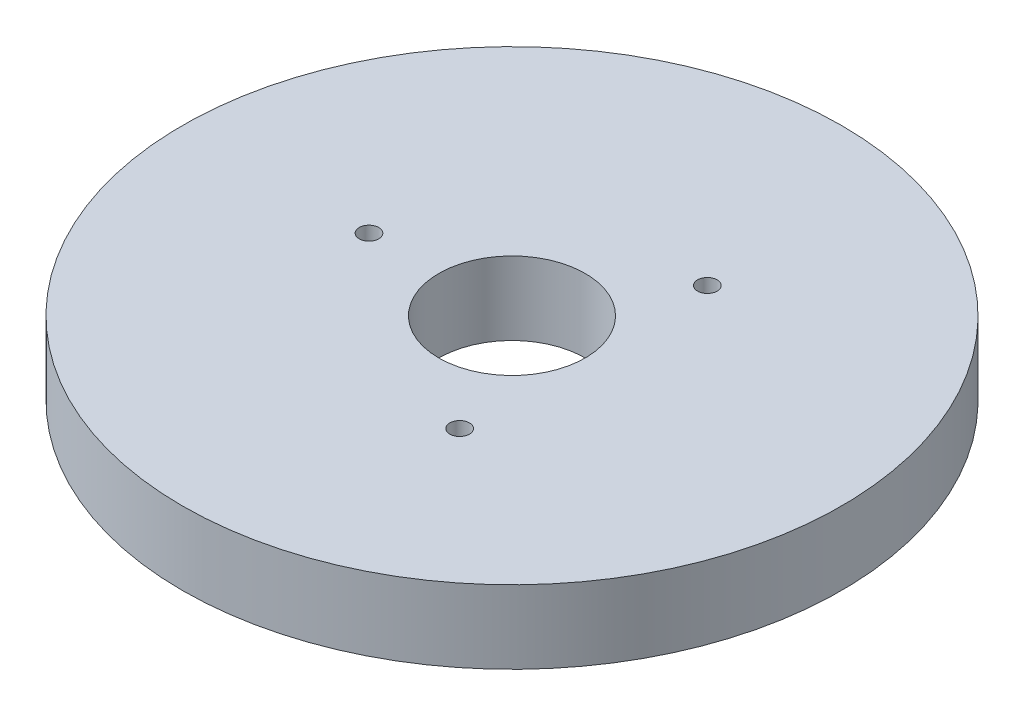
ISO-10303-21;
HEADER;
FILE_DESCRIPTION(('STEP AP214'),'2;1');
FILE_NAME('part.step','',(''),(''),'','','');
FILE_SCHEMA(('AUTOMOTIVE_DESIGN { 1 0 10303 214 1 1 1 1 }'));
ENDSEC;
DATA;
#1=APPLICATION_CONTEXT('core data for automotive mechanical design processes');
#2=APPLICATION_PROTOCOL_DEFINITION('international standard','automotive_design',2000,#1);
#3=PRODUCT_CONTEXT('',#1,'mechanical');
#4=PRODUCT('Part','Part','',(#3));
#5=PRODUCT_RELATED_PRODUCT_CATEGORY('part','',(#4));
#6=PRODUCT_DEFINITION_FORMATION('','',#4);
#7=PRODUCT_DEFINITION_CONTEXT('part definition',#1,'design');
#8=PRODUCT_DEFINITION('design','',#6,#7);
#9=PRODUCT_DEFINITION_SHAPE('','',#8);
#10=(LENGTH_UNIT() NAMED_UNIT(*) SI_UNIT(.MILLI.,.METRE.));
#11=(NAMED_UNIT(*) PLANE_ANGLE_UNIT() SI_UNIT($,.RADIAN.));
#12=(NAMED_UNIT(*) SI_UNIT($,.STERADIAN.) SOLID_ANGLE_UNIT());
#13=UNCERTAINTY_MEASURE_WITH_UNIT(LENGTH_MEASURE(1.E-05),#10,'distance_accuracy_value','');
#14=(GEOMETRIC_REPRESENTATION_CONTEXT(3) GLOBAL_UNCERTAINTY_ASSIGNED_CONTEXT((#13)) GLOBAL_UNIT_ASSIGNED_CONTEXT((#10,
#11,#12)) REPRESENTATION_CONTEXT('',''));
#15=CARTESIAN_POINT('',(0.,0.,0.));
#16=DIRECTION('',(0.,0.,1.));
#17=DIRECTION('',(1.,0.,0.));
#18=AXIS2_PLACEMENT_3D('',#15,#16,#17);
#19=CARTESIAN_POINT('',(0.,20.,0.));
#20=DIRECTION('',(0.,-1.,0.));
#21=DIRECTION('',(0.,0.,-1.));
#22=AXIS2_PLACEMENT_3D('',#19,#20,#21);
#23=CYLINDRICAL_SURFACE('',#22,90.);
#24=CARTESIAN_POINT('',(0.,20.,0.));
#25=DIRECTION('',(0.,1.,0.));
#26=DIRECTION('',(0.,0.,1.));
#27=AXIS2_PLACEMENT_3D('',#24,#25,#26);
#28=CIRCLE('',#27,90.);
#29=CARTESIAN_POINT('',(0.,20.,90.));
#30=VERTEX_POINT('',#29);
#31=EDGE_CURVE('E10',#30,#30,#28,.T.);
#32=ORIENTED_EDGE('',*,*,#31,.F.);
#33=EDGE_LOOP('',(#32));
#34=FACE_BOUND('',#33,.T.);
#35=CARTESIAN_POINT('',(0.,0.,0.));
#36=DIRECTION('',(0.,1.,0.));
#37=DIRECTION('',(0.,0.,1.));
#38=AXIS2_PLACEMENT_3D('',#35,#36,#37);
#39=CIRCLE('',#38,90.);
#40=CARTESIAN_POINT('',(0.,0.,90.));
#41=VERTEX_POINT('',#40);
#42=EDGE_CURVE('E37',#41,#41,#39,.T.);
#43=ORIENTED_EDGE('',*,*,#42,.T.);
#44=EDGE_LOOP('',(#43));
#45=FACE_BOUND('',#44,.T.);
#46=ADVANCED_FACE('F40',(#34,#45),#23,.T.);
#47=CARTESIAN_POINT('',(0.,20.,0.));
#48=DIRECTION('',(0.,1.,0.));
#49=DIRECTION('',(0.,0.,1.));
#50=AXIS2_PLACEMENT_3D('',#47,#48,#49);
#51=PLANE('',#50);
#52=CARTESIAN_POINT('',(19.5290018990693,20.,33.8252235102968));
#53=DIRECTION('',(0.,1.,0.));
#54=DIRECTION('',(0.866025403784436,0.,-0.500000000000004));
#55=AXIS2_PLACEMENT_3D('',#52,#53,#54);
#56=CIRCLE('',#55,2.67580100674816);
#57=CARTESIAN_POINT('',(21.8463135463852,20.,32.4873230069227));
#58=VERTEX_POINT('',#57);
#59=EDGE_CURVE('E70',#58,#58,#56,.T.);
#60=ORIENTED_EDGE('',*,*,#59,.F.);
#61=EDGE_LOOP('',(#60));
#62=FACE_BOUND('',#61,.T.);
#63=CARTESIAN_POINT('',(19.5290018990688,20.,-33.825223510297));
#64=DIRECTION('',(0.,1.,0.));
#65=DIRECTION('',(-0.866025403784443,0.,-0.499999999999992));
#66=AXIS2_PLACEMENT_3D('',#63,#64,#65);
#67=CIRCLE('',#66,2.67580100674816);
#68=CARTESIAN_POINT('',(17.2116902517529,20.,-35.1631240136711));
#69=VERTEX_POINT('',#68);
#70=EDGE_CURVE('E61',#69,#69,#67,.T.);
#71=ORIENTED_EDGE('',*,*,#70,.F.);
#72=EDGE_LOOP('',(#71));
#73=FACE_BOUND('',#72,.T.);
#74=CARTESIAN_POINT('',(-39.0580037981383,20.,0.));
#75=DIRECTION('',(0.,1.,0.));
#76=DIRECTION('',(0.,0.,1.));
#77=AXIS2_PLACEMENT_3D('',#74,#75,#76);
#78=CIRCLE('',#77,2.67580100674816);
#79=CARTESIAN_POINT('',(-39.0580037981383,20.,2.67580100674816));
#80=VERTEX_POINT('',#79);
#81=EDGE_CURVE('E54',#80,#80,#78,.T.);
#82=ORIENTED_EDGE('',*,*,#81,.F.);
#83=EDGE_LOOP('',(#82));
#84=FACE_BOUND('',#83,.T.);
#85=CARTESIAN_POINT('',(0.,20.,0.));
#86=DIRECTION('',(0.,1.,0.));
#87=DIRECTION('',(0.,0.,1.));
#88=AXIS2_PLACEMENT_3D('',#85,#86,#87);
#89=CIRCLE('',#88,20.);
#90=CARTESIAN_POINT('',(0.,20.,20.));
#91=VERTEX_POINT('',#90);
#92=EDGE_CURVE('E50',#91,#91,#89,.T.);
#93=ORIENTED_EDGE('',*,*,#92,.F.);
#94=EDGE_LOOP('',(#93));
#95=FACE_BOUND('',#94,.T.);
#96=ORIENTED_EDGE('',*,*,#31,.T.);
#97=EDGE_LOOP('',(#96));
#98=FACE_BOUND('',#97,.T.);
#99=ADVANCED_FACE('F85',(#62,#73,#84,#95,#98),#51,.T.);
#100=CARTESIAN_POINT('',(0.,0.,0.));
#101=DIRECTION('',(0.,1.,0.));
#102=DIRECTION('',(0.,0.,1.));
#103=AXIS2_PLACEMENT_3D('',#100,#101,#102);
#104=PLANE('',#103);
#105=CARTESIAN_POINT('',(0.,0.,0.));
#106=DIRECTION('',(0.,1.,0.));
#107=DIRECTION('',(0.,0.,1.));
#108=AXIS2_PLACEMENT_3D('',#105,#106,#107);
#109=CIRCLE('',#108,20.);
#110=CARTESIAN_POINT('',(0.,0.,20.));
#111=VERTEX_POINT('',#110);
#112=EDGE_CURVE('E47',#111,#111,#109,.T.);
#113=ORIENTED_EDGE('',*,*,#112,.T.);
#114=EDGE_LOOP('',(#113));
#115=FACE_BOUND('',#114,.T.);
#116=ORIENTED_EDGE('',*,*,#42,.F.);
#117=EDGE_LOOP('',(#116));
#118=FACE_BOUND('',#117,.T.);
#119=ADVANCED_FACE('F84',(#115,#118),#104,.F.);
#120=CARTESIAN_POINT('',(0.,20.,0.));
#121=DIRECTION('',(0.,-1.,0.));
#122=DIRECTION('',(0.,0.,-1.));
#123=AXIS2_PLACEMENT_3D('',#120,#121,#122);
#124=CYLINDRICAL_SURFACE('',#123,20.);
#125=ORIENTED_EDGE('',*,*,#92,.T.);
#126=EDGE_LOOP('',(#125));
#127=FACE_BOUND('',#126,.T.);
#128=ORIENTED_EDGE('',*,*,#112,.F.);
#129=EDGE_LOOP('',(#128));
#130=FACE_BOUND('',#129,.T.);
#131=ADVANCED_FACE('F91',(#127,#130),#124,.F.);
#132=CARTESIAN_POINT('',(-39.0580037981383,7.75066715070129,0.));
#133=DIRECTION('',(0.,1.,0.));
#134=DIRECTION('',(0.,0.,1.));
#135=AXIS2_PLACEMENT_3D('',#132,#133,#134);
#136=CYLINDRICAL_SURFACE('',#135,2.67580100674816);
#137=CARTESIAN_POINT('',(-39.0580037981383,7.75066715070129,0.));
#138=DIRECTION('',(0.,1.,0.));
#139=DIRECTION('',(0.,0.,1.));
#140=AXIS2_PLACEMENT_3D('',#137,#138,#139);
#141=CIRCLE('',#140,2.67580100674816);
#142=CARTESIAN_POINT('',(-39.0580037981383,7.75066715070129,2.67580100674816));
#143=VERTEX_POINT('',#142);
#144=EDGE_CURVE('E55',#143,#143,#141,.T.);
#145=ORIENTED_EDGE('',*,*,#144,.F.);
#146=EDGE_LOOP('',(#145));
#147=FACE_BOUND('',#146,.T.);
#148=ORIENTED_EDGE('',*,*,#81,.T.);
#149=EDGE_LOOP('',(#148));
#150=FACE_BOUND('',#149,.T.);
#151=ADVANCED_FACE('F96',(#147,#150),#136,.F.);
#152=CARTESIAN_POINT('',(-39.0580037981383,7.75066715070129,0.));
#153=DIRECTION('',(0.,1.,0.));
#154=DIRECTION('',(0.,0.,1.));
#155=AXIS2_PLACEMENT_3D('',#152,#153,#154);
#156=PLANE('',#155);
#157=ORIENTED_EDGE('',*,*,#144,.T.);
#158=EDGE_LOOP('',(#157));
#159=FACE_BOUND('',#158,.T.);
#160=ADVANCED_FACE('F127',(#159),#156,.T.);
#161=CARTESIAN_POINT('',(19.5290018990688,7.75066715070129,-33.825223510297));
#162=DIRECTION('',(0.,1.,0.));
#163=DIRECTION('',(0.,0.,1.));
#164=AXIS2_PLACEMENT_3D('',#161,#162,#163);
#165=CYLINDRICAL_SURFACE('',#164,2.67580100674816);
#166=CARTESIAN_POINT('',(19.5290018990688,7.75066715070129,-33.825223510297));
#167=DIRECTION('',(0.,1.,0.));
#168=DIRECTION('',(-0.866025403784443,0.,-0.499999999999992));
#169=AXIS2_PLACEMENT_3D('',#166,#167,#168);
#170=CIRCLE('',#169,2.67580100674816);
#171=CARTESIAN_POINT('',(17.2116902517529,7.75066715070129,-35.1631240136711));
#172=VERTEX_POINT('',#171);
#173=EDGE_CURVE('E63',#172,#172,#170,.T.);
#174=ORIENTED_EDGE('',*,*,#173,.F.);
#175=EDGE_LOOP('',(#174));
#176=FACE_BOUND('',#175,.T.);
#177=ORIENTED_EDGE('',*,*,#70,.T.);
#178=EDGE_LOOP('',(#177));
#179=FACE_BOUND('',#178,.T.);
#180=ADVANCED_FACE('F133',(#176,#179),#165,.F.);
#181=CARTESIAN_POINT('',(19.5290018990688,7.75066715070129,-33.825223510297));
#182=DIRECTION('',(0.,1.,0.));
#183=DIRECTION('',(-0.866025403784443,0.,-0.499999999999992));
#184=AXIS2_PLACEMENT_3D('',#181,#182,#183);
#185=PLANE('',#184);
#186=ORIENTED_EDGE('',*,*,#173,.T.);
#187=EDGE_LOOP('',(#186));
#188=FACE_BOUND('',#187,.T.);
#189=ADVANCED_FACE('F77',(#188),#185,.T.);
#190=CARTESIAN_POINT('',(19.5290018990693,7.75066715070129,33.8252235102968));
#191=DIRECTION('',(0.,1.,0.));
#192=DIRECTION('',(0.,0.,1.));
#193=AXIS2_PLACEMENT_3D('',#190,#191,#192);
#194=CYLINDRICAL_SURFACE('',#193,2.67580100674816);
#195=CARTESIAN_POINT('',(19.5290018990693,7.75066715070129,33.8252235102968));
#196=DIRECTION('',(0.,1.,0.));
#197=DIRECTION('',(0.866025403784436,0.,-0.500000000000004));
#198=AXIS2_PLACEMENT_3D('',#195,#196,#197);
#199=CIRCLE('',#198,2.67580100674816);
#200=CARTESIAN_POINT('',(21.8463135463852,7.75066715070129,32.4873230069227));
#201=VERTEX_POINT('',#200);
#202=EDGE_CURVE('E59',#201,#201,#199,.T.);
#203=ORIENTED_EDGE('',*,*,#202,.F.);
#204=EDGE_LOOP('',(#203));
#205=FACE_BOUND('',#204,.T.);
#206=ORIENTED_EDGE('',*,*,#59,.T.);
#207=EDGE_LOOP('',(#206));
#208=FACE_BOUND('',#207,.T.);
#209=ADVANCED_FACE('F73',(#205,#208),#194,.F.);
#210=CARTESIAN_POINT('',(19.5290018990693,7.75066715070129,33.8252235102968));
#211=DIRECTION('',(0.,1.,0.));
#212=DIRECTION('',(0.866025403784436,0.,-0.500000000000004));
#213=AXIS2_PLACEMENT_3D('',#210,#211,#212);
#214=PLANE('',#213);
#215=ORIENTED_EDGE('',*,*,#202,.T.);
#216=EDGE_LOOP('',(#215));
#217=FACE_BOUND('',#216,.T.);
#218=ADVANCED_FACE('F71',(#217),#214,.T.);
#219=CLOSED_SHELL('',(#46,#99,#119,#131,#151,#160,#180,#189,#209,#218));
#220=MANIFOLD_SOLID_BREP('B2',#219);
#221=ADVANCED_BREP_SHAPE_REPRESENTATION('',(#18,#220),#14);
#222=SHAPE_DEFINITION_REPRESENTATION(#9,#221);
ENDSEC;
END-ISO-10303-21;
